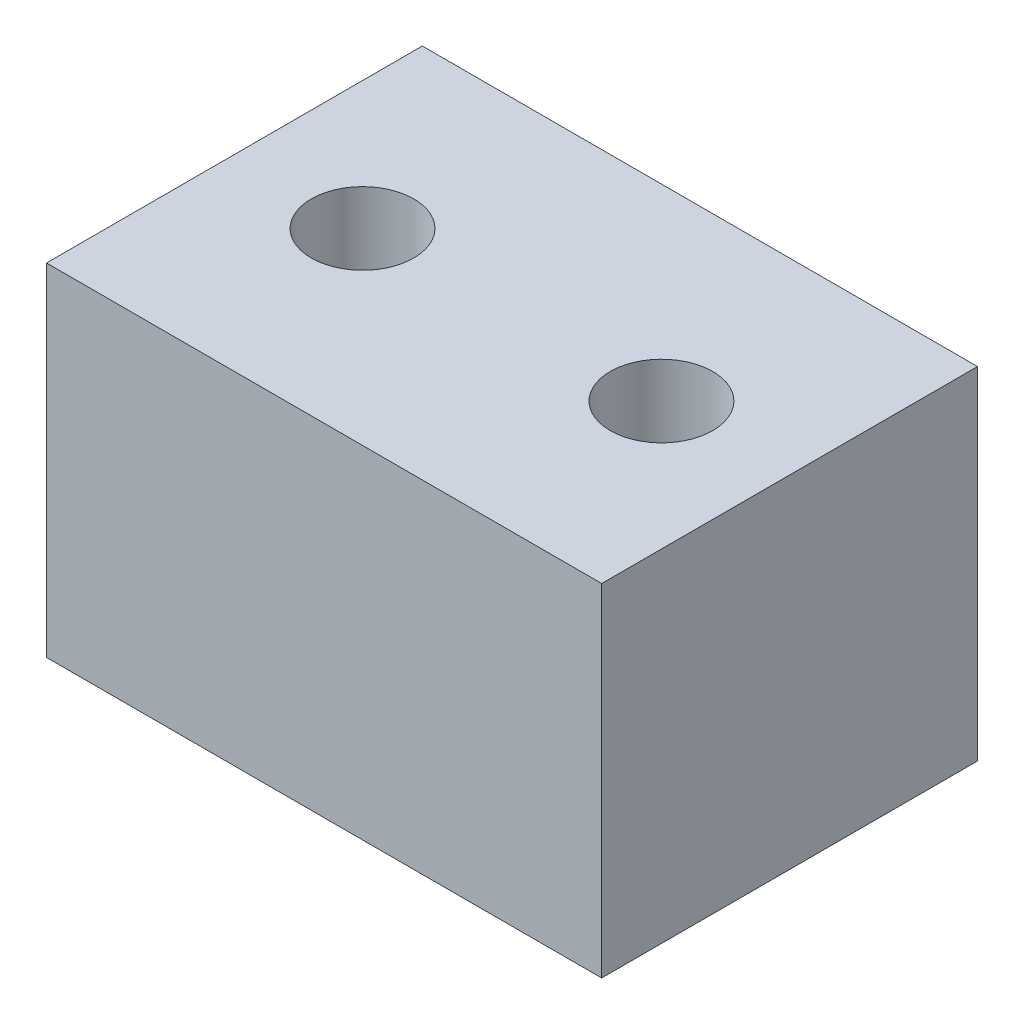
ISO-10303-21;
HEADER;
FILE_DESCRIPTION(('STEP AP214'),'2;1');
FILE_NAME('part.step','',(''),(''),'','','');
FILE_SCHEMA(('AUTOMOTIVE_DESIGN { 1 0 10303 214 1 1 1 1 }'));
ENDSEC;
DATA;
#1=APPLICATION_CONTEXT('core data for automotive mechanical design processes');
#2=APPLICATION_PROTOCOL_DEFINITION('international standard','automotive_design',2000,#1);
#3=PRODUCT_CONTEXT('',#1,'mechanical');
#4=PRODUCT('Part','Part','',(#3));
#5=PRODUCT_RELATED_PRODUCT_CATEGORY('part','',(#4));
#6=PRODUCT_DEFINITION_FORMATION('','',#4);
#7=PRODUCT_DEFINITION_CONTEXT('part definition',#1,'design');
#8=PRODUCT_DEFINITION('design','',#6,#7);
#9=PRODUCT_DEFINITION_SHAPE('','',#8);
#10=(LENGTH_UNIT() NAMED_UNIT(*) SI_UNIT(.MILLI.,.METRE.));
#11=(NAMED_UNIT(*) PLANE_ANGLE_UNIT() SI_UNIT($,.RADIAN.));
#12=(NAMED_UNIT(*) SI_UNIT($,.STERADIAN.) SOLID_ANGLE_UNIT());
#13=UNCERTAINTY_MEASURE_WITH_UNIT(LENGTH_MEASURE(1.E-05),#10,'distance_accuracy_value','');
#14=(GEOMETRIC_REPRESENTATION_CONTEXT(3) GLOBAL_UNCERTAINTY_ASSIGNED_CONTEXT((#13)) GLOBAL_UNIT_ASSIGNED_CONTEXT((#10,
#11,#12)) REPRESENTATION_CONTEXT('',''));
#15=CARTESIAN_POINT('',(0.,0.,0.));
#16=DIRECTION('',(0.,0.,1.));
#17=DIRECTION('',(1.,0.,0.));
#18=AXIS2_PLACEMENT_3D('',#15,#16,#17);
#19=CARTESIAN_POINT('',(12.7090053763441,40.,0.));
#20=DIRECTION('',(-1.,0.,0.));
#21=DIRECTION('',(0.,0.,1.));
#22=AXIS2_PLACEMENT_3D('',#19,#20,#21);
#23=PLANE('',#22);
#24=DIRECTION('',(0.,0.,-1.));
#25=VECTOR('',#24,1.);
#26=CARTESIAN_POINT('',(12.7090053763441,0.,0.));
#27=LINE('',#26,#25);
#28=CARTESIAN_POINT('',(12.7090053763441,0.,15.3719758064516));
#29=VERTEX_POINT('',#28);
#30=CARTESIAN_POINT('',(12.7090053763441,0.,-28.6280241935484));
#31=VERTEX_POINT('',#30);
#32=EDGE_CURVE('E105',#29,#31,#27,.T.);
#33=ORIENTED_EDGE('',*,*,#32,.T.);
#34=DIRECTION('',(0.,-1.,0.));
#35=VECTOR('',#34,1.);
#36=CARTESIAN_POINT('',(12.7090053763441,40.,-28.6280241935484));
#37=LINE('',#36,#35);
#38=CARTESIAN_POINT('',(12.7090053763441,40.,-28.6280241935484));
#39=VERTEX_POINT('',#38);
#40=EDGE_CURVE('E11',#39,#31,#37,.T.);
#41=ORIENTED_EDGE('',*,*,#40,.F.);
#42=DIRECTION('',(0.,0.,-1.));
#43=VECTOR('',#42,1.);
#44=CARTESIAN_POINT('',(12.7090053763441,40.,0.));
#45=LINE('',#44,#43);
#46=CARTESIAN_POINT('',(12.7090053763441,40.,15.3719758064516));
#47=VERTEX_POINT('',#46);
#48=EDGE_CURVE('E87',#47,#39,#45,.T.);
#49=ORIENTED_EDGE('',*,*,#48,.F.);
#50=DIRECTION('',(0.,-1.,0.));
#51=VECTOR('',#50,1.);
#52=CARTESIAN_POINT('',(12.7090053763441,40.,15.3719758064516));
#53=LINE('',#52,#51);
#54=EDGE_CURVE('E95',#47,#29,#53,.T.);
#55=ORIENTED_EDGE('',*,*,#54,.T.);
#56=EDGE_LOOP('',(#33,#41,#49,#55));
#57=FACE_BOUND('',#56,.T.);
#58=ADVANCED_FACE('F35',(#57),#23,.F.);
#59=CARTESIAN_POINT('',(0.,40.,-28.6280241935484));
#60=DIRECTION('',(0.,0.,1.));
#61=DIRECTION('',(1.,0.,0.));
#62=AXIS2_PLACEMENT_3D('',#59,#60,#61);
#63=PLANE('',#62);
#64=DIRECTION('',(-1.,0.,0.));
#65=VECTOR('',#64,1.);
#66=CARTESIAN_POINT('',(0.,0.,-28.6280241935484));
#67=LINE('',#66,#65);
#68=CARTESIAN_POINT('',(-52.2909946236559,0.,-28.6280241935484));
#69=VERTEX_POINT('',#68);
#70=EDGE_CURVE('E91',#31,#69,#67,.T.);
#71=ORIENTED_EDGE('',*,*,#70,.T.);
#72=DIRECTION('',(0.,-1.,0.));
#73=VECTOR('',#72,1.);
#74=CARTESIAN_POINT('',(-52.2909946236559,40.,-28.6280241935484));
#75=LINE('',#74,#73);
#76=CARTESIAN_POINT('',(-52.2909946236559,40.,-28.6280241935484));
#77=VERTEX_POINT('',#76);
#78=EDGE_CURVE('E44',#77,#69,#75,.T.);
#79=ORIENTED_EDGE('',*,*,#78,.F.);
#80=DIRECTION('',(-1.,0.,0.));
#81=VECTOR('',#80,1.);
#82=CARTESIAN_POINT('',(0.,40.,-28.6280241935484));
#83=LINE('',#82,#81);
#84=EDGE_CURVE('E82',#39,#77,#83,.T.);
#85=ORIENTED_EDGE('',*,*,#84,.F.);
#86=ORIENTED_EDGE('',*,*,#40,.T.);
#87=EDGE_LOOP('',(#71,#79,#85,#86));
#88=FACE_BOUND('',#87,.T.);
#89=ADVANCED_FACE('F90',(#88),#63,.F.);
#90=CARTESIAN_POINT('',(-52.2909946236559,40.,0.));
#91=DIRECTION('',(1.,0.,0.));
#92=DIRECTION('',(0.,0.,-1.));
#93=AXIS2_PLACEMENT_3D('',#90,#91,#92);
#94=PLANE('',#93);
#95=DIRECTION('',(0.,0.,1.));
#96=VECTOR('',#95,1.);
#97=CARTESIAN_POINT('',(-52.2909946236559,0.,0.));
#98=LINE('',#97,#96);
#99=CARTESIAN_POINT('',(-52.2909946236559,0.,15.3719758064516));
#100=VERTEX_POINT('',#99);
#101=EDGE_CURVE('E69',#69,#100,#98,.T.);
#102=ORIENTED_EDGE('',*,*,#101,.T.);
#103=DIRECTION('',(0.,-1.,0.));
#104=VECTOR('',#103,1.);
#105=CARTESIAN_POINT('',(-52.2909946236559,40.,15.3719758064516));
#106=LINE('',#105,#104);
#107=CARTESIAN_POINT('',(-52.2909946236559,40.,15.3719758064516));
#108=VERTEX_POINT('',#107);
#109=EDGE_CURVE('E92',#108,#100,#106,.T.);
#110=ORIENTED_EDGE('',*,*,#109,.F.);
#111=DIRECTION('',(0.,0.,1.));
#112=VECTOR('',#111,1.);
#113=CARTESIAN_POINT('',(-52.2909946236559,40.,0.));
#114=LINE('',#113,#112);
#115=EDGE_CURVE('E85',#77,#108,#114,.T.);
#116=ORIENTED_EDGE('',*,*,#115,.F.);
#117=ORIENTED_EDGE('',*,*,#78,.T.);
#118=EDGE_LOOP('',(#102,#110,#116,#117));
#119=FACE_BOUND('',#118,.T.);
#120=ADVANCED_FACE('F93',(#119),#94,.F.);
#121=CARTESIAN_POINT('',(-37.2909946236559,40.,-6.62802419354837));
#122=DIRECTION('',(0.,-1.,0.));
#123=DIRECTION('',(0.,0.,-1.));
#124=AXIS2_PLACEMENT_3D('',#121,#122,#123);
#125=CYLINDRICAL_SURFACE('',#124,6.);
#126=CARTESIAN_POINT('',(-37.2909946236559,40.,-6.62802419354837));
#127=DIRECTION('',(0.,1.,0.));
#128=DIRECTION('',(0.,0.,1.));
#129=AXIS2_PLACEMENT_3D('',#126,#127,#128);
#130=CIRCLE('',#129,6.);
#131=CARTESIAN_POINT('',(-37.2909946236559,40.,-0.628024193548373));
#132=VERTEX_POINT('',#131);
#133=EDGE_CURVE('E118',#132,#132,#130,.T.);
#134=ORIENTED_EDGE('',*,*,#133,.T.);
#135=EDGE_LOOP('',(#134));
#136=FACE_BOUND('',#135,.T.);
#137=CARTESIAN_POINT('',(-37.2909946236559,0.,-6.62802419354837));
#138=DIRECTION('',(0.,1.,0.));
#139=DIRECTION('',(0.,0.,1.));
#140=AXIS2_PLACEMENT_3D('',#137,#138,#139);
#141=CIRCLE('',#140,6.);
#142=CARTESIAN_POINT('',(-37.2909946236559,0.,-0.628024193548373));
#143=VERTEX_POINT('',#142);
#144=EDGE_CURVE('E102',#143,#143,#141,.T.);
#145=ORIENTED_EDGE('',*,*,#144,.F.);
#146=EDGE_LOOP('',(#145));
#147=FACE_BOUND('',#146,.T.);
#148=ADVANCED_FACE('F132',(#136,#147),#125,.F.);
#149=CARTESIAN_POINT('',(-2.29099462365591,40.,-6.62802419354838));
#150=DIRECTION('',(0.,-1.,0.));
#151=DIRECTION('',(0.,0.,-1.));
#152=AXIS2_PLACEMENT_3D('',#149,#150,#151);
#153=CYLINDRICAL_SURFACE('',#152,6.);
#154=CARTESIAN_POINT('',(-2.29099462365591,40.,-6.62802419354838));
#155=DIRECTION('',(0.,1.,0.));
#156=DIRECTION('',(0.,0.,1.));
#157=AXIS2_PLACEMENT_3D('',#154,#155,#156);
#158=CIRCLE('',#157,6.);
#159=CARTESIAN_POINT('',(-2.29099462365591,40.,-0.628024193548377));
#160=VERTEX_POINT('',#159);
#161=EDGE_CURVE('E111',#160,#160,#158,.T.);
#162=ORIENTED_EDGE('',*,*,#161,.T.);
#163=EDGE_LOOP('',(#162));
#164=FACE_BOUND('',#163,.T.);
#165=CARTESIAN_POINT('',(-2.29099462365591,0.,-6.62802419354838));
#166=DIRECTION('',(0.,1.,0.));
#167=DIRECTION('',(0.,0.,1.));
#168=AXIS2_PLACEMENT_3D('',#165,#166,#167);
#169=CIRCLE('',#168,6.);
#170=CARTESIAN_POINT('',(-2.29099462365591,0.,-0.628024193548377));
#171=VERTEX_POINT('',#170);
#172=EDGE_CURVE('E99',#171,#171,#169,.T.);
#173=ORIENTED_EDGE('',*,*,#172,.F.);
#174=EDGE_LOOP('',(#173));
#175=FACE_BOUND('',#174,.T.);
#176=ADVANCED_FACE('F37',(#164,#175),#153,.F.);
#177=CARTESIAN_POINT('',(0.,40.,15.3719758064516));
#178=DIRECTION('',(0.,0.,-1.));
#179=DIRECTION('',(-1.,0.,0.));
#180=AXIS2_PLACEMENT_3D('',#177,#178,#179);
#181=PLANE('',#180);
#182=DIRECTION('',(1.,0.,0.));
#183=VECTOR('',#182,1.);
#184=CARTESIAN_POINT('',(0.,0.,15.3719758064516));
#185=LINE('',#184,#183);
#186=EDGE_CURVE('E75',#100,#29,#185,.T.);
#187=ORIENTED_EDGE('',*,*,#186,.T.);
#188=ORIENTED_EDGE('',*,*,#54,.F.);
#189=DIRECTION('',(1.,0.,0.));
#190=VECTOR('',#189,1.);
#191=CARTESIAN_POINT('',(0.,40.,15.3719758064516));
#192=LINE('',#191,#190);
#193=EDGE_CURVE('E52',#108,#47,#192,.T.);
#194=ORIENTED_EDGE('',*,*,#193,.F.);
#195=ORIENTED_EDGE('',*,*,#109,.T.);
#196=EDGE_LOOP('',(#187,#188,#194,#195));
#197=FACE_BOUND('',#196,.T.);
#198=ADVANCED_FACE('F113',(#197),#181,.F.);
#199=CARTESIAN_POINT('',(0.,40.,0.));
#200=DIRECTION('',(0.,1.,0.));
#201=DIRECTION('',(0.,0.,1.));
#202=AXIS2_PLACEMENT_3D('',#199,#200,#201);
#203=PLANE('',#202);
#204=ORIENTED_EDGE('',*,*,#161,.F.);
#205=EDGE_LOOP('',(#204));
#206=FACE_BOUND('',#205,.T.);
#207=ORIENTED_EDGE('',*,*,#133,.F.);
#208=EDGE_LOOP('',(#207));
#209=FACE_BOUND('',#208,.T.);
#210=ORIENTED_EDGE('',*,*,#48,.T.);
#211=ORIENTED_EDGE('',*,*,#84,.T.);
#212=ORIENTED_EDGE('',*,*,#115,.T.);
#213=ORIENTED_EDGE('',*,*,#193,.T.);
#214=EDGE_LOOP('',(#210,#211,#212,#213));
#215=FACE_BOUND('',#214,.T.);
#216=ADVANCED_FACE('F83',(#206,#209,#215),#203,.T.);
#217=CARTESIAN_POINT('',(0.,0.,0.));
#218=DIRECTION('',(0.,1.,0.));
#219=DIRECTION('',(0.,0.,1.));
#220=AXIS2_PLACEMENT_3D('',#217,#218,#219);
#221=PLANE('',#220);
#222=ORIENTED_EDGE('',*,*,#172,.T.);
#223=EDGE_LOOP('',(#222));
#224=FACE_BOUND('',#223,.T.);
#225=ORIENTED_EDGE('',*,*,#144,.T.);
#226=EDGE_LOOP('',(#225));
#227=FACE_BOUND('',#226,.T.);
#228=ORIENTED_EDGE('',*,*,#32,.F.);
#229=ORIENTED_EDGE('',*,*,#186,.F.);
#230=ORIENTED_EDGE('',*,*,#101,.F.);
#231=ORIENTED_EDGE('',*,*,#70,.F.);
#232=EDGE_LOOP('',(#228,#229,#230,#231));
#233=FACE_BOUND('',#232,.T.);
#234=ADVANCED_FACE('F116',(#224,#227,#233),#221,.F.);
#235=CLOSED_SHELL('',(#58,#89,#120,#148,#176,#198,#216,#234));
#236=MANIFOLD_SOLID_BREP('B2',#235);
#237=ADVANCED_BREP_SHAPE_REPRESENTATION('',(#18,#236),#14);
#238=SHAPE_DEFINITION_REPRESENTATION(#9,#237);
ENDSEC;
END-ISO-10303-21;
